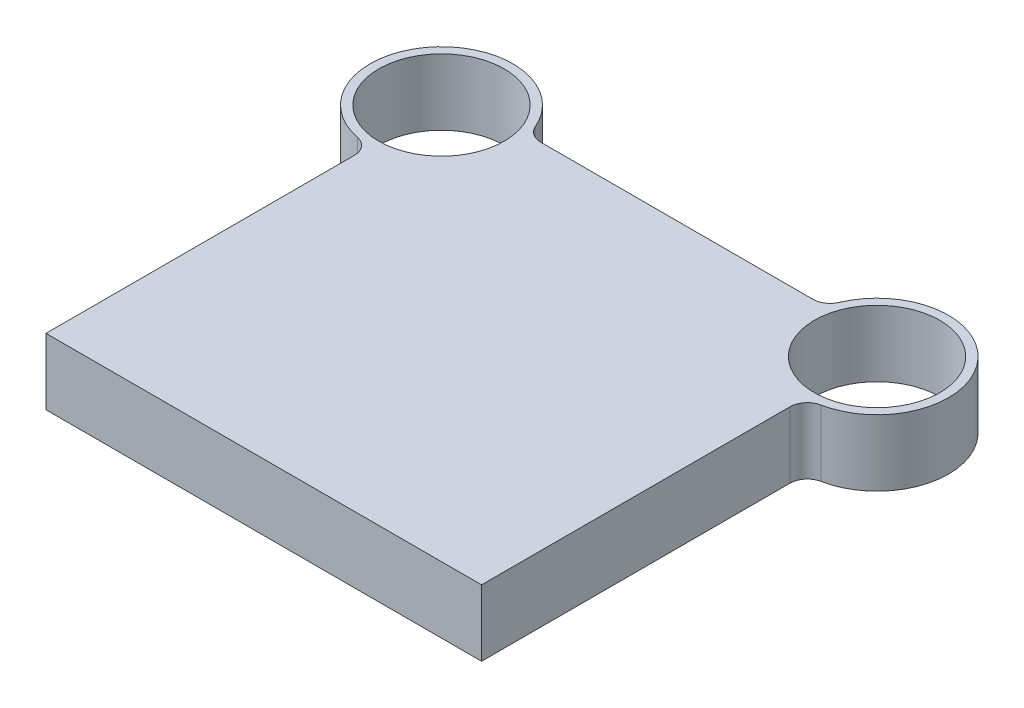
ISO-10303-21;
HEADER;
FILE_DESCRIPTION(('STEP AP214'),'2;1');
FILE_NAME('part.step','',(''),(''),'','','');
FILE_SCHEMA(('AUTOMOTIVE_DESIGN { 1 0 10303 214 1 1 1 1 }'));
ENDSEC;
DATA;
#1=APPLICATION_CONTEXT('core data for automotive mechanical design processes');
#2=APPLICATION_PROTOCOL_DEFINITION('international standard','automotive_design',2000,#1);
#3=PRODUCT_CONTEXT('',#1,'mechanical');
#4=PRODUCT('Part','Part','',(#3));
#5=PRODUCT_RELATED_PRODUCT_CATEGORY('part','',(#4));
#6=PRODUCT_DEFINITION_FORMATION('','',#4);
#7=PRODUCT_DEFINITION_CONTEXT('part definition',#1,'design');
#8=PRODUCT_DEFINITION('design','',#6,#7);
#9=PRODUCT_DEFINITION_SHAPE('','',#8);
#10=(LENGTH_UNIT() NAMED_UNIT(*) SI_UNIT(.MILLI.,.METRE.));
#11=(NAMED_UNIT(*) PLANE_ANGLE_UNIT() SI_UNIT($,.RADIAN.));
#12=(NAMED_UNIT(*) SI_UNIT($,.STERADIAN.) SOLID_ANGLE_UNIT());
#13=UNCERTAINTY_MEASURE_WITH_UNIT(LENGTH_MEASURE(1.E-05),#10,'distance_accuracy_value','');
#14=(GEOMETRIC_REPRESENTATION_CONTEXT(3) GLOBAL_UNCERTAINTY_ASSIGNED_CONTEXT((#13)) GLOBAL_UNIT_ASSIGNED_CONTEXT((#10,
#11,#12)) REPRESENTATION_CONTEXT('',''));
#15=CARTESIAN_POINT('',(0.,0.,0.));
#16=DIRECTION('',(0.,0.,1.));
#17=DIRECTION('',(1.,0.,0.));
#18=AXIS2_PLACEMENT_3D('',#15,#16,#17);
#19=CARTESIAN_POINT('',(-125.,38.,-227.));
#20=DIRECTION('',(0.,1.,0.));
#21=DIRECTION('',(0.,0.,1.));
#22=AXIS2_PLACEMENT_3D('',#19,#20,#21);
#23=PLANE('',#22);
#24=CARTESIAN_POINT('',(-125.,38.,-227.));
#25=DIRECTION('',(0.,1.,0.));
#26=DIRECTION('',(0.,0.,1.));
#27=AXIS2_PLACEMENT_3D('',#24,#25,#26);
#28=CIRCLE('',#27,36.);
#29=CARTESIAN_POINT('',(-125.,38.,-191.));
#30=VERTEX_POINT('',#29);
#31=EDGE_CURVE('E195',#30,#30,#28,.T.);
#32=ORIENTED_EDGE('',*,*,#31,.F.);
#33=EDGE_LOOP('',(#32));
#34=FACE_BOUND('',#33,.T.);
#35=CARTESIAN_POINT('',(-125.,38.,-227.));
#36=DIRECTION('',(0.,1.,0.));
#37=DIRECTION('',(0.,0.,1.));
#38=AXIS2_PLACEMENT_3D('',#35,#36,#37);
#39=CIRCLE('',#38,41.);
#40=CARTESIAN_POINT('',(-87.2841671893854,38.,-243.078431372549));
#41=VERTEX_POINT('',#40);
#42=CARTESIAN_POINT('',(-133.039215686275,38.,-186.795883156702));
#43=VERTEX_POINT('',#42);
#44=EDGE_CURVE('E141',#41,#43,#39,.T.);
#45=ORIENTED_EDGE('',*,*,#44,.T.);
#46=CARTESIAN_POINT('',(-135.,38.,-176.9900009998));
#47=DIRECTION('',(0.,1.,0.));
#48=DIRECTION('',(0.,0.,1.));
#49=AXIS2_PLACEMENT_3D('',#46,#47,#48);
#50=CIRCLE('',#49,10.);
#51=CARTESIAN_POINT('',(-125.,38.,-176.9900009998));
#52=VERTEX_POINT('',#51);
#53=EDGE_CURVE('E117',#43,#52,#50,.F.);
#54=ORIENTED_EDGE('',*,*,#53,.T.);
#55=DIRECTION('',(0.,0.,1.));
#56=VECTOR('',#55,1.);
#57=CARTESIAN_POINT('',(-125.,38.,0.));
#58=LINE('',#57,#56);
#59=CARTESIAN_POINT('',(-125.,38.,0.));
#60=VERTEX_POINT('',#59);
#61=EDGE_CURVE('E109',#52,#60,#58,.T.);
#62=ORIENTED_EDGE('',*,*,#61,.T.);
#63=DIRECTION('',(1.,0.,0.));
#64=VECTOR('',#63,1.);
#65=CARTESIAN_POINT('',(125.,38.,0.));
#66=LINE('',#65,#64);
#67=CARTESIAN_POINT('',(125.,38.,0.));
#68=VERTEX_POINT('',#67);
#69=EDGE_CURVE('E114',#60,#68,#66,.T.);
#70=ORIENTED_EDGE('',*,*,#69,.T.);
#71=DIRECTION('',(0.,0.,-1.));
#72=VECTOR('',#71,1.);
#73=CARTESIAN_POINT('',(125.,38.,0.));
#74=LINE('',#73,#72);
#75=CARTESIAN_POINT('',(125.,38.,-176.9900009998));
#76=VERTEX_POINT('',#75);
#77=EDGE_CURVE('E131',#68,#76,#74,.T.);
#78=ORIENTED_EDGE('',*,*,#77,.T.);
#79=CARTESIAN_POINT('',(135.,38.,-176.9900009998));
#80=DIRECTION('',(0.,1.,0.));
#81=DIRECTION('',(0.,0.,1.));
#82=AXIS2_PLACEMENT_3D('',#79,#80,#81);
#83=CIRCLE('',#82,10.);
#84=CARTESIAN_POINT('',(133.039215686275,38.,-186.795883156702));
#85=VERTEX_POINT('',#84);
#86=EDGE_CURVE('E165',#76,#85,#83,.F.);
#87=ORIENTED_EDGE('',*,*,#86,.T.);
#88=CARTESIAN_POINT('',(125.,38.,-227.));
#89=DIRECTION('',(0.,1.,0.));
#90=DIRECTION('',(0.,0.,-1.));
#91=AXIS2_PLACEMENT_3D('',#88,#89,#90);
#92=CIRCLE('',#91,41.);
#93=CARTESIAN_POINT('',(87.2841671893854,38.,-243.078431372549));
#94=VERTEX_POINT('',#93);
#95=EDGE_CURVE('E189',#85,#94,#92,.T.);
#96=ORIENTED_EDGE('',*,*,#95,.T.);
#97=CARTESIAN_POINT('',(78.0851835770404,38.,-247.));
#98=DIRECTION('',(0.,1.,0.));
#99=DIRECTION('',(0.,0.,1.));
#100=AXIS2_PLACEMENT_3D('',#97,#98,#99);
#101=CIRCLE('',#100,10.);
#102=CARTESIAN_POINT('',(78.0851835770404,38.,-237.));
#103=VERTEX_POINT('',#102);
#104=EDGE_CURVE('E55',#94,#103,#101,.F.);
#105=ORIENTED_EDGE('',*,*,#104,.T.);
#106=DIRECTION('',(-1.,0.,0.));
#107=VECTOR('',#106,1.);
#108=CARTESIAN_POINT('',(85.2382092958579,38.,-237.));
#109=LINE('',#108,#107);
#110=CARTESIAN_POINT('',(-78.0851835770404,38.,-237.));
#111=VERTEX_POINT('',#110);
#112=EDGE_CURVE('E184',#103,#111,#109,.T.);
#113=ORIENTED_EDGE('',*,*,#112,.T.);
#114=CARTESIAN_POINT('',(-78.0851835770404,38.,-247.));
#115=DIRECTION('',(0.,1.,0.));
#116=DIRECTION('',(0.,0.,1.));
#117=AXIS2_PLACEMENT_3D('',#114,#115,#116);
#118=CIRCLE('',#117,10.);
#119=EDGE_CURVE('E11',#111,#41,#118,.F.);
#120=ORIENTED_EDGE('',*,*,#119,.T.);
#121=EDGE_LOOP('',(#45,#54,#62,#70,#78,#87,#96,#105,#113,#120));
#122=FACE_BOUND('',#121,.T.);
#123=CARTESIAN_POINT('',(125.,38.,-227.));
#124=DIRECTION('',(0.,1.,0.));
#125=DIRECTION('',(0.,0.,-1.));
#126=AXIS2_PLACEMENT_3D('',#123,#124,#125);
#127=CIRCLE('',#126,36.);
#128=CARTESIAN_POINT('',(125.,38.,-263.));
#129=VERTEX_POINT('',#128);
#130=EDGE_CURVE('E213',#129,#129,#127,.T.);
#131=ORIENTED_EDGE('',*,*,#130,.F.);
#132=EDGE_LOOP('',(#131));
#133=FACE_BOUND('',#132,.T.);
#134=ADVANCED_FACE('F33',(#34,#122,#133),#23,.T.);
#135=CARTESIAN_POINT('',(-125.,0.,-227.));
#136=DIRECTION('',(0.,1.,0.));
#137=DIRECTION('',(0.,0.,1.));
#138=AXIS2_PLACEMENT_3D('',#135,#136,#137);
#139=PLANE('',#138);
#140=DIRECTION('',(0.,0.,1.));
#141=VECTOR('',#140,1.);
#142=CARTESIAN_POINT('',(-125.,0.,0.));
#143=LINE('',#142,#141);
#144=CARTESIAN_POINT('',(-125.,0.,-176.9900009998));
#145=VERTEX_POINT('',#144);
#146=CARTESIAN_POINT('',(-125.,0.,0.));
#147=VERTEX_POINT('',#146);
#148=EDGE_CURVE('E135',#145,#147,#143,.T.);
#149=ORIENTED_EDGE('',*,*,#148,.F.);
#150=CARTESIAN_POINT('',(-135.,0.,-176.9900009998));
#151=DIRECTION('',(0.,1.,0.));
#152=DIRECTION('',(0.,0.,1.));
#153=AXIS2_PLACEMENT_3D('',#150,#151,#152);
#154=CIRCLE('',#153,10.);
#155=CARTESIAN_POINT('',(-133.039215686275,0.,-186.795883156702));
#156=VERTEX_POINT('',#155);
#157=EDGE_CURVE('E160',#145,#156,#154,.T.);
#158=ORIENTED_EDGE('',*,*,#157,.T.);
#159=CARTESIAN_POINT('',(-125.,0.,-227.));
#160=DIRECTION('',(0.,1.,0.));
#161=DIRECTION('',(0.,0.,1.));
#162=AXIS2_PLACEMENT_3D('',#159,#160,#161);
#163=CIRCLE('',#162,41.);
#164=CARTESIAN_POINT('',(-87.2841671893854,0.,-243.078431372549));
#165=VERTEX_POINT('',#164);
#166=EDGE_CURVE('E122',#165,#156,#163,.T.);
#167=ORIENTED_EDGE('',*,*,#166,.F.);
#168=CARTESIAN_POINT('',(-78.0851835770404,0.,-247.));
#169=DIRECTION('',(0.,1.,0.));
#170=DIRECTION('',(0.,0.,1.));
#171=AXIS2_PLACEMENT_3D('',#168,#169,#170);
#172=CIRCLE('',#171,10.);
#173=CARTESIAN_POINT('',(-78.0851835770404,0.,-237.));
#174=VERTEX_POINT('',#173);
#175=EDGE_CURVE('E41',#165,#174,#172,.T.);
#176=ORIENTED_EDGE('',*,*,#175,.T.);
#177=DIRECTION('',(-1.,0.,0.));
#178=VECTOR('',#177,1.);
#179=CARTESIAN_POINT('',(85.2382092958579,0.,-237.));
#180=LINE('',#179,#178);
#181=CARTESIAN_POINT('',(78.0851835770404,0.,-237.));
#182=VERTEX_POINT('',#181);
#183=EDGE_CURVE('E174',#182,#174,#180,.T.);
#184=ORIENTED_EDGE('',*,*,#183,.F.);
#185=CARTESIAN_POINT('',(78.0851835770404,0.,-247.));
#186=DIRECTION('',(0.,1.,0.));
#187=DIRECTION('',(0.,0.,1.));
#188=AXIS2_PLACEMENT_3D('',#185,#186,#187);
#189=CIRCLE('',#188,10.);
#190=CARTESIAN_POINT('',(87.2841671893854,0.,-243.078431372549));
#191=VERTEX_POINT('',#190);
#192=EDGE_CURVE('E167',#182,#191,#189,.T.);
#193=ORIENTED_EDGE('',*,*,#192,.T.);
#194=CARTESIAN_POINT('',(125.,0.,-227.));
#195=DIRECTION('',(0.,1.,0.));
#196=DIRECTION('',(0.,0.,-1.));
#197=AXIS2_PLACEMENT_3D('',#194,#195,#196);
#198=CIRCLE('',#197,41.);
#199=CARTESIAN_POINT('',(133.039215686275,0.,-186.795883156702));
#200=VERTEX_POINT('',#199);
#201=EDGE_CURVE('E180',#200,#191,#198,.T.);
#202=ORIENTED_EDGE('',*,*,#201,.F.);
#203=CARTESIAN_POINT('',(135.,0.,-176.9900009998));
#204=DIRECTION('',(0.,1.,0.));
#205=DIRECTION('',(0.,0.,1.));
#206=AXIS2_PLACEMENT_3D('',#203,#204,#205);
#207=CIRCLE('',#206,10.);
#208=CARTESIAN_POINT('',(125.,0.,-176.9900009998));
#209=VERTEX_POINT('',#208);
#210=EDGE_CURVE('E163',#200,#209,#207,.T.);
#211=ORIENTED_EDGE('',*,*,#210,.T.);
#212=DIRECTION('',(0.,0.,-1.));
#213=VECTOR('',#212,1.);
#214=CARTESIAN_POINT('',(125.,0.,0.));
#215=LINE('',#214,#213);
#216=CARTESIAN_POINT('',(125.,0.,0.));
#217=VERTEX_POINT('',#216);
#218=EDGE_CURVE('E197',#217,#209,#215,.T.);
#219=ORIENTED_EDGE('',*,*,#218,.F.);
#220=DIRECTION('',(1.,0.,0.));
#221=VECTOR('',#220,1.);
#222=CARTESIAN_POINT('',(125.,0.,0.));
#223=LINE('',#222,#221);
#224=EDGE_CURVE('E194',#147,#217,#223,.T.);
#225=ORIENTED_EDGE('',*,*,#224,.F.);
#226=EDGE_LOOP('',(#149,#158,#167,#176,#184,#193,#202,#211,#219,#225));
#227=FACE_BOUND('',#226,.T.);
#228=CARTESIAN_POINT('',(-125.,0.,-227.));
#229=DIRECTION('',(0.,1.,0.));
#230=DIRECTION('',(0.,0.,1.));
#231=AXIS2_PLACEMENT_3D('',#228,#229,#230);
#232=CIRCLE('',#231,36.);
#233=CARTESIAN_POINT('',(-125.,0.,-191.));
#234=VERTEX_POINT('',#233);
#235=EDGE_CURVE('E210',#234,#234,#232,.T.);
#236=ORIENTED_EDGE('',*,*,#235,.T.);
#237=EDGE_LOOP('',(#236));
#238=FACE_BOUND('',#237,.T.);
#239=CARTESIAN_POINT('',(125.,0.,-227.));
#240=DIRECTION('',(0.,1.,0.));
#241=DIRECTION('',(0.,0.,-1.));
#242=AXIS2_PLACEMENT_3D('',#239,#240,#241);
#243=CIRCLE('',#242,36.);
#244=CARTESIAN_POINT('',(125.,0.,-263.));
#245=VERTEX_POINT('',#244);
#246=EDGE_CURVE('E216',#245,#245,#243,.T.);
#247=ORIENTED_EDGE('',*,*,#246,.T.);
#248=EDGE_LOOP('',(#247));
#249=FACE_BOUND('',#248,.T.);
#250=ADVANCED_FACE('F172',(#227,#238,#249),#139,.F.);
#251=CARTESIAN_POINT('',(-125.,38.,0.));
#252=DIRECTION('',(1.,0.,0.));
#253=DIRECTION('',(0.,0.,-1.));
#254=AXIS2_PLACEMENT_3D('',#251,#252,#253);
#255=PLANE('',#254);
#256=ORIENTED_EDGE('',*,*,#61,.F.);
#257=DIRECTION('',(0.,1.,0.));
#258=VECTOR('',#257,1.);
#259=CARTESIAN_POINT('',(-125.,0.,-176.9900009998));
#260=LINE('',#259,#258);
#261=EDGE_CURVE('E137',#52,#145,#260,.F.);
#262=ORIENTED_EDGE('',*,*,#261,.T.);
#263=ORIENTED_EDGE('',*,*,#148,.T.);
#264=DIRECTION('',(0.,-1.,0.));
#265=VECTOR('',#264,1.);
#266=CARTESIAN_POINT('',(-125.,38.,0.));
#267=LINE('',#266,#265);
#268=EDGE_CURVE('E127',#60,#147,#267,.T.);
#269=ORIENTED_EDGE('',*,*,#268,.F.);
#270=EDGE_LOOP('',(#256,#262,#263,#269));
#271=FACE_BOUND('',#270,.T.);
#272=ADVANCED_FACE('F133',(#271),#255,.F.);
#273=CARTESIAN_POINT('',(125.,38.,0.));
#274=DIRECTION('',(0.,0.,-1.));
#275=DIRECTION('',(-1.,0.,0.));
#276=AXIS2_PLACEMENT_3D('',#273,#274,#275);
#277=PLANE('',#276);
#278=ORIENTED_EDGE('',*,*,#224,.T.);
#279=DIRECTION('',(0.,-1.,0.));
#280=VECTOR('',#279,1.);
#281=CARTESIAN_POINT('',(125.,38.,0.));
#282=LINE('',#281,#280);
#283=EDGE_CURVE('E129',#68,#217,#282,.T.);
#284=ORIENTED_EDGE('',*,*,#283,.F.);
#285=ORIENTED_EDGE('',*,*,#69,.F.);
#286=ORIENTED_EDGE('',*,*,#268,.T.);
#287=EDGE_LOOP('',(#278,#284,#285,#286));
#288=FACE_BOUND('',#287,.T.);
#289=ADVANCED_FACE('F126',(#288),#277,.F.);
#290=CARTESIAN_POINT('',(125.,38.,0.));
#291=DIRECTION('',(-1.,0.,0.));
#292=DIRECTION('',(0.,0.,1.));
#293=AXIS2_PLACEMENT_3D('',#290,#291,#292);
#294=PLANE('',#293);
#295=ORIENTED_EDGE('',*,*,#218,.T.);
#296=DIRECTION('',(0.,1.,0.));
#297=VECTOR('',#296,1.);
#298=CARTESIAN_POINT('',(125.,38.,-176.9900009998));
#299=LINE('',#298,#297);
#300=EDGE_CURVE('E154',#209,#76,#299,.T.);
#301=ORIENTED_EDGE('',*,*,#300,.T.);
#302=ORIENTED_EDGE('',*,*,#77,.F.);
#303=ORIENTED_EDGE('',*,*,#283,.T.);
#304=EDGE_LOOP('',(#295,#301,#302,#303));
#305=FACE_BOUND('',#304,.T.);
#306=ADVANCED_FACE('F205',(#305),#294,.F.);
#307=CARTESIAN_POINT('',(125.,38.,-227.));
#308=DIRECTION('',(0.,-1.,0.));
#309=DIRECTION('',(0.,0.,-1.));
#310=AXIS2_PLACEMENT_3D('',#307,#308,#309);
#311=CYLINDRICAL_SURFACE('',#310,41.);
#312=ORIENTED_EDGE('',*,*,#95,.F.);
#313=DIRECTION('',(0.,-1.,0.));
#314=VECTOR('',#313,1.);
#315=CARTESIAN_POINT('',(133.039215686275,38.,-186.795883156702));
#316=LINE('',#315,#314);
#317=EDGE_CURVE('E151',#85,#200,#316,.T.);
#318=ORIENTED_EDGE('',*,*,#317,.T.);
#319=ORIENTED_EDGE('',*,*,#201,.T.);
#320=DIRECTION('',(0.,-1.,0.));
#321=VECTOR('',#320,1.);
#322=CARTESIAN_POINT('',(87.2841671893854,38.,-243.078431372549));
#323=LINE('',#322,#321);
#324=EDGE_CURVE('E149',#191,#94,#323,.F.);
#325=ORIENTED_EDGE('',*,*,#324,.T.);
#326=EDGE_LOOP('',(#312,#318,#319,#325));
#327=FACE_BOUND('',#326,.T.);
#328=ADVANCED_FACE('F240',(#327),#311,.T.);
#329=CARTESIAN_POINT('',(85.2382092958579,38.,-237.));
#330=DIRECTION('',(0.,0.,1.));
#331=DIRECTION('',(1.,0.,0.));
#332=AXIS2_PLACEMENT_3D('',#329,#330,#331);
#333=PLANE('',#332);
#334=ORIENTED_EDGE('',*,*,#112,.F.);
#335=DIRECTION('',(0.,1.,0.));
#336=VECTOR('',#335,1.);
#337=CARTESIAN_POINT('',(78.0851835770404,0.,-237.));
#338=LINE('',#337,#336);
#339=EDGE_CURVE('E157',#103,#182,#338,.F.);
#340=ORIENTED_EDGE('',*,*,#339,.T.);
#341=ORIENTED_EDGE('',*,*,#183,.T.);
#342=DIRECTION('',(0.,1.,0.));
#343=VECTOR('',#342,1.);
#344=CARTESIAN_POINT('',(-78.0851835770404,38.,-237.));
#345=LINE('',#344,#343);
#346=EDGE_CURVE('E48',#174,#111,#345,.T.);
#347=ORIENTED_EDGE('',*,*,#346,.T.);
#348=EDGE_LOOP('',(#334,#340,#341,#347));
#349=FACE_BOUND('',#348,.T.);
#350=ADVANCED_FACE('F178',(#349),#333,.F.);
#351=CARTESIAN_POINT('',(-125.,38.,-227.));
#352=DIRECTION('',(0.,-1.,0.));
#353=DIRECTION('',(0.,0.,-1.));
#354=AXIS2_PLACEMENT_3D('',#351,#352,#353);
#355=CYLINDRICAL_SURFACE('',#354,41.);
#356=ORIENTED_EDGE('',*,*,#166,.T.);
#357=DIRECTION('',(0.,-1.,0.));
#358=VECTOR('',#357,1.);
#359=CARTESIAN_POINT('',(-133.039215686275,38.,-186.795883156702));
#360=LINE('',#359,#358);
#361=EDGE_CURVE('E147',#156,#43,#360,.F.);
#362=ORIENTED_EDGE('',*,*,#361,.T.);
#363=ORIENTED_EDGE('',*,*,#44,.F.);
#364=DIRECTION('',(0.,-1.,0.));
#365=VECTOR('',#364,1.);
#366=CARTESIAN_POINT('',(-87.2841671893854,38.,-243.078431372549));
#367=LINE('',#366,#365);
#368=EDGE_CURVE('E139',#41,#165,#367,.T.);
#369=ORIENTED_EDGE('',*,*,#368,.T.);
#370=EDGE_LOOP('',(#356,#362,#363,#369));
#371=FACE_BOUND('',#370,.T.);
#372=ADVANCED_FACE('F186',(#371),#355,.T.);
#373=CARTESIAN_POINT('',(-125.,38.,-227.));
#374=DIRECTION('',(0.,-1.,0.));
#375=DIRECTION('',(0.,0.,-1.));
#376=AXIS2_PLACEMENT_3D('',#373,#374,#375);
#377=CYLINDRICAL_SURFACE('',#376,36.);
#378=ORIENTED_EDGE('',*,*,#31,.T.);
#379=EDGE_LOOP('',(#378));
#380=FACE_BOUND('',#379,.T.);
#381=ORIENTED_EDGE('',*,*,#235,.F.);
#382=EDGE_LOOP('',(#381));
#383=FACE_BOUND('',#382,.T.);
#384=ADVANCED_FACE('F233',(#380,#383),#377,.F.);
#385=CARTESIAN_POINT('',(125.,38.,-227.));
#386=DIRECTION('',(0.,-1.,0.));
#387=DIRECTION('',(0.,0.,-1.));
#388=AXIS2_PLACEMENT_3D('',#385,#386,#387);
#389=CYLINDRICAL_SURFACE('',#388,36.);
#390=ORIENTED_EDGE('',*,*,#130,.T.);
#391=EDGE_LOOP('',(#390));
#392=FACE_BOUND('',#391,.T.);
#393=ORIENTED_EDGE('',*,*,#246,.F.);
#394=EDGE_LOOP('',(#393));
#395=FACE_BOUND('',#394,.T.);
#396=ADVANCED_FACE('F222',(#392,#395),#389,.F.);
#397=CARTESIAN_POINT('',(-135.,38.,-176.9900009998));
#398=DIRECTION('',(0.,-1.,0.));
#399=DIRECTION('',(0.,0.,-1.));
#400=AXIS2_PLACEMENT_3D('',#397,#398,#399);
#401=CYLINDRICAL_SURFACE('',#400,10.);
#402=ORIENTED_EDGE('',*,*,#53,.F.);
#403=ORIENTED_EDGE('',*,*,#361,.F.);
#404=ORIENTED_EDGE('',*,*,#157,.F.);
#405=ORIENTED_EDGE('',*,*,#261,.F.);
#406=EDGE_LOOP('',(#402,#403,#404,#405));
#407=FACE_BOUND('',#406,.T.);
#408=ADVANCED_FACE('F202',(#407),#401,.F.);
#409=CARTESIAN_POINT('',(135.,38.,-176.9900009998));
#410=DIRECTION('',(0.,-1.,0.));
#411=DIRECTION('',(0.,0.,-1.));
#412=AXIS2_PLACEMENT_3D('',#409,#410,#411);
#413=CYLINDRICAL_SURFACE('',#412,10.);
#414=ORIENTED_EDGE('',*,*,#86,.F.);
#415=ORIENTED_EDGE('',*,*,#300,.F.);
#416=ORIENTED_EDGE('',*,*,#210,.F.);
#417=ORIENTED_EDGE('',*,*,#317,.F.);
#418=EDGE_LOOP('',(#414,#415,#416,#417));
#419=FACE_BOUND('',#418,.T.);
#420=ADVANCED_FACE('F252',(#419),#413,.F.);
#421=CARTESIAN_POINT('',(78.0851835770404,38.,-247.));
#422=DIRECTION('',(0.,-1.,0.));
#423=DIRECTION('',(0.,0.,-1.));
#424=AXIS2_PLACEMENT_3D('',#421,#422,#423);
#425=CYLINDRICAL_SURFACE('',#424,10.);
#426=ORIENTED_EDGE('',*,*,#104,.F.);
#427=ORIENTED_EDGE('',*,*,#324,.F.);
#428=ORIENTED_EDGE('',*,*,#192,.F.);
#429=ORIENTED_EDGE('',*,*,#339,.F.);
#430=EDGE_LOOP('',(#426,#427,#428,#429));
#431=FACE_BOUND('',#430,.T.);
#432=ADVANCED_FACE('F254',(#431),#425,.F.);
#433=CARTESIAN_POINT('',(-78.0851835770404,38.,-247.));
#434=DIRECTION('',(0.,-1.,0.));
#435=DIRECTION('',(0.,0.,-1.));
#436=AXIS2_PLACEMENT_3D('',#433,#434,#435);
#437=CYLINDRICAL_SURFACE('',#436,10.);
#438=ORIENTED_EDGE('',*,*,#119,.F.);
#439=ORIENTED_EDGE('',*,*,#346,.F.);
#440=ORIENTED_EDGE('',*,*,#175,.F.);
#441=ORIENTED_EDGE('',*,*,#368,.F.);
#442=EDGE_LOOP('',(#438,#439,#440,#441));
#443=FACE_BOUND('',#442,.T.);
#444=ADVANCED_FACE('F35',(#443),#437,.F.);
#445=CLOSED_SHELL('',(#134,#250,#272,#289,#306,#328,#350,#372,#384,#396,#408,#420,#432,#444));
#446=MANIFOLD_SOLID_BREP('B2',#445);
#447=ADVANCED_BREP_SHAPE_REPRESENTATION('',(#18,#446),#14);
#448=SHAPE_DEFINITION_REPRESENTATION(#9,#447);
ENDSEC;
END-ISO-10303-21;
